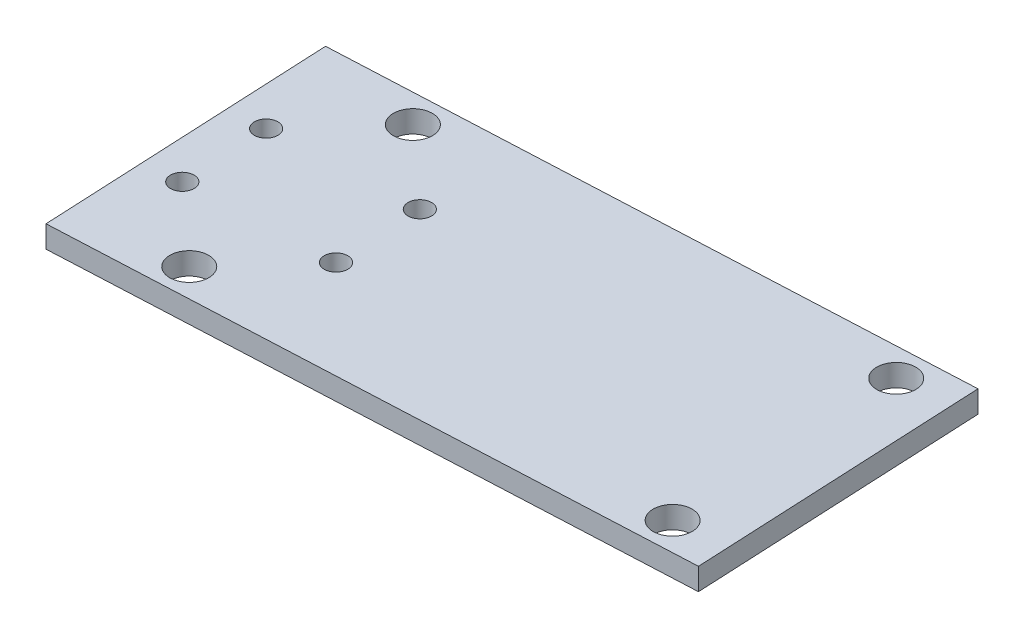
ISO-10303-21;
HEADER;
FILE_DESCRIPTION(('STEP AP214'),'2;1');
FILE_NAME('part.step','',(''),(''),'','','');
FILE_SCHEMA(('AUTOMOTIVE_DESIGN { 1 0 10303 214 1 1 1 1 }'));
ENDSEC;
DATA;
#1=APPLICATION_CONTEXT('core data for automotive mechanical design processes');
#2=APPLICATION_PROTOCOL_DEFINITION('international standard','automotive_design',2000,#1);
#3=PRODUCT_CONTEXT('',#1,'mechanical');
#4=PRODUCT('Part','Part','',(#3));
#5=PRODUCT_RELATED_PRODUCT_CATEGORY('part','',(#4));
#6=PRODUCT_DEFINITION_FORMATION('','',#4);
#7=PRODUCT_DEFINITION_CONTEXT('part definition',#1,'design');
#8=PRODUCT_DEFINITION('design','',#6,#7);
#9=PRODUCT_DEFINITION_SHAPE('','',#8);
#10=(LENGTH_UNIT() NAMED_UNIT(*) SI_UNIT(.MILLI.,.METRE.));
#11=(NAMED_UNIT(*) PLANE_ANGLE_UNIT() SI_UNIT($,.RADIAN.));
#12=(NAMED_UNIT(*) SI_UNIT($,.STERADIAN.) SOLID_ANGLE_UNIT());
#13=UNCERTAINTY_MEASURE_WITH_UNIT(LENGTH_MEASURE(1.E-05),#10,'distance_accuracy_value','');
#14=(GEOMETRIC_REPRESENTATION_CONTEXT(3) GLOBAL_UNCERTAINTY_ASSIGNED_CONTEXT((#13)) GLOBAL_UNIT_ASSIGNED_CONTEXT((#10,
#11,#12)) REPRESENTATION_CONTEXT('',''));
#15=CARTESIAN_POINT('',(0.,0.,0.));
#16=DIRECTION('',(0.,0.,1.));
#17=DIRECTION('',(1.,0.,0.));
#18=AXIS2_PLACEMENT_3D('',#15,#16,#17);
#19=CARTESIAN_POINT('',(0.,3.,0.));
#20=DIRECTION('',(0.,1.,0.));
#21=DIRECTION('',(0.,0.,1.));
#22=AXIS2_PLACEMENT_3D('',#19,#20,#21);
#23=PLANE('',#22);
#24=CARTESIAN_POINT('',(62.773467576915,3.,-19.533037480713));
#25=DIRECTION('',(0.,1.,0.));
#26=DIRECTION('',(0.,0.,1.));
#27=AXIS2_PLACEMENT_3D('',#24,#25,#26);
#28=CIRCLE('',#27,2.65);
#29=CARTESIAN_POINT('',(62.773467576915,3.,-16.883037480713));
#30=VERTEX_POINT('',#29);
#31=EDGE_CURVE('E145',#30,#30,#28,.T.);
#32=ORIENTED_EDGE('',*,*,#31,.F.);
#33=EDGE_LOOP('',(#32));
#34=FACE_BOUND('',#33,.T.);
#35=CARTESIAN_POINT('',(10.413791266194,3.,-7.03358197308624));
#36=DIRECTION('',(0.,1.,0.));
#37=DIRECTION('',(0.,0.,-1.));
#38=AXIS2_PLACEMENT_3D('',#35,#36,#37);
#39=CIRCLE('',#38,1.6);
#40=CARTESIAN_POINT('',(10.413791266194,3.,-8.63358197308624));
#41=VERTEX_POINT('',#40);
#42=EDGE_CURVE('E133',#41,#41,#39,.T.);
#43=ORIENTED_EDGE('',*,*,#42,.F.);
#44=EDGE_LOOP('',(#43));
#45=FACE_BOUND('',#44,.T.);
#46=CARTESIAN_POINT('',(-8.9940585563237,3.,5.90223517414487));
#47=DIRECTION('',(0.,1.,0.));
#48=DIRECTION('',(0.,0.,1.));
#49=AXIS2_PLACEMENT_3D('',#46,#47,#48);
#50=CIRCLE('',#49,1.6);
#51=CARTESIAN_POINT('',(-8.9940585563237,3.,7.50223517414487));
#52=VERTEX_POINT('',#51);
#53=EDGE_CURVE('E121',#52,#52,#50,.T.);
#54=ORIENTED_EDGE('',*,*,#53,.F.);
#55=EDGE_LOOP('',(#54));
#56=FACE_BOUND('',#55,.T.);
#57=CARTESIAN_POINT('',(-0.0496085001945169,3.,-16.5476381705627));
#58=DIRECTION('',(0.,1.,0.));
#59=DIRECTION('',(0.,0.,1.));
#60=AXIS2_PLACEMENT_3D('',#57,#58,#59);
#61=CIRCLE('',#60,2.65);
#62=CARTESIAN_POINT('',(-0.0496085001945169,3.,-13.8976381705627));
#63=VERTEX_POINT('',#62);
#64=EDGE_CURVE('E103',#63,#63,#61,.T.);
#65=ORIENTED_EDGE('',*,*,#64,.F.);
#66=EDGE_LOOP('',(#65));
#67=FACE_BOUND('',#66,.T.);
#68=DIRECTION('',(0.0474671784456058,0.,0.99887279819325));
#69=VECTOR('',#68,1.);
#70=CARTESIAN_POINT('',(-15.2225691868757,3.,-19.8311216866516));
#71=LINE('',#70,#69);
#72=CARTESIAN_POINT('',(-15.2225691868757,3.,-19.8311216866516));
#73=VERTEX_POINT('',#72);
#74=CARTESIAN_POINT('',(-13.3238820490515,3.,20.1237902410784));
#75=VERTEX_POINT('',#74);
#76=EDGE_CURVE('E86',#73,#75,#71,.T.);
#77=ORIENTED_EDGE('',*,*,#76,.T.);
#78=DIRECTION('',(0.99887279819325,0.,-0.0474671784456056));
#79=VECTOR('',#78,1.);
#80=CARTESIAN_POINT('',(-13.3238820490515,3.,20.1237902410784));
#81=LINE('',#80,#79);
#82=CARTESIAN_POINT('',(71.4743955883095,3.,16.0941130051248));
#83=VERTEX_POINT('',#82);
#84=EDGE_CURVE('E80',#75,#83,#81,.T.);
#85=ORIENTED_EDGE('',*,*,#84,.T.);
#86=DIRECTION('',(-0.0474671784456058,0.,-0.99887279819325));
#87=VECTOR('',#86,1.);
#88=CARTESIAN_POINT('',(69.5757084504853,3.,-23.8607989226052));
#89=LINE('',#88,#87);
#90=CARTESIAN_POINT('',(69.5757084504853,3.,-23.8607989226052));
#91=VERTEX_POINT('',#90);
#92=EDGE_CURVE('E83',#83,#91,#89,.T.);
#93=ORIENTED_EDGE('',*,*,#92,.T.);
#94=DIRECTION('',(-0.99887279819325,0.,0.0474671784456059));
#95=VECTOR('',#94,1.);
#96=CARTESIAN_POINT('',(14.7436147589218,3.,-21.2551370400198));
#97=LINE('',#96,#95);
#98=EDGE_CURVE('E52',#91,#73,#97,.T.);
#99=ORIENTED_EDGE('',*,*,#98,.T.);
#100=EDGE_LOOP('',(#77,#85,#93,#99));
#101=FACE_BOUND('',#100,.T.);
#102=CARTESIAN_POINT('',(1.46934121006486,3.,15.4162913716213));
#103=DIRECTION('',(0.,1.,0.));
#104=DIRECTION('',(0.,0.,1.));
#105=AXIS2_PLACEMENT_3D('',#102,#103,#104);
#106=CIRCLE('',#105,2.65);
#107=CARTESIAN_POINT('',(1.46934121006486,3.,18.0662913716213));
#108=VERTEX_POINT('',#107);
#109=EDGE_CURVE('E115',#108,#108,#106,.T.);
#110=ORIENTED_EDGE('',*,*,#109,.F.);
#111=EDGE_LOOP('',(#110));
#112=FACE_BOUND('',#111,.T.);
#113=CARTESIAN_POINT('',(-9.56366469767096,3.,-6.08423840417413));
#114=DIRECTION('',(0.,1.,0.));
#115=DIRECTION('',(0.,0.,1.));
#116=AXIS2_PLACEMENT_3D('',#113,#114,#115);
#117=CIRCLE('',#116,1.6);
#118=CARTESIAN_POINT('',(-9.56366469767096,3.,-4.48423840417412));
#119=VERTEX_POINT('',#118);
#120=EDGE_CURVE('E127',#119,#119,#117,.T.);
#121=ORIENTED_EDGE('',*,*,#120,.F.);
#122=EDGE_LOOP('',(#121));
#123=FACE_BOUND('',#122,.T.);
#124=CARTESIAN_POINT('',(10.9833974075413,3.,4.95289160523276));
#125=DIRECTION('',(0.,1.,0.));
#126=DIRECTION('',(0.,0.,-1.));
#127=AXIS2_PLACEMENT_3D('',#124,#125,#126);
#128=CIRCLE('',#127,1.6);
#129=CARTESIAN_POINT('',(10.9833974075413,3.,3.35289160523276));
#130=VERTEX_POINT('',#129);
#131=EDGE_CURVE('E139',#130,#130,#128,.T.);
#132=ORIENTED_EDGE('',*,*,#131,.F.);
#133=EDGE_LOOP('',(#132));
#134=FACE_BOUND('',#133,.T.);
#135=CARTESIAN_POINT('',(64.2924172871744,3.,12.430892061471));
#136=DIRECTION('',(0.,1.,0.));
#137=DIRECTION('',(0.,0.,1.));
#138=AXIS2_PLACEMENT_3D('',#135,#136,#137);
#139=CIRCLE('',#138,2.65);
#140=CARTESIAN_POINT('',(64.2924172871744,3.,15.080892061471));
#141=VERTEX_POINT('',#140);
#142=EDGE_CURVE('E151',#141,#141,#139,.T.);
#143=ORIENTED_EDGE('',*,*,#142,.F.);
#144=EDGE_LOOP('',(#143));
#145=FACE_BOUND('',#144,.T.);
#146=ADVANCED_FACE('F35',(#34,#45,#56,#67,#101,#112,#123,#134,#145),#23,.T.);
#147=CARTESIAN_POINT('',(0.,0.,0.));
#148=DIRECTION('',(0.,1.,0.));
#149=DIRECTION('',(0.,0.,1.));
#150=AXIS2_PLACEMENT_3D('',#147,#148,#149);
#151=PLANE('',#150);
#152=DIRECTION('',(0.0474671784456058,0.,0.99887279819325));
#153=VECTOR('',#152,1.);
#154=CARTESIAN_POINT('',(-15.2225691868757,0.,-19.8311216866516));
#155=LINE('',#154,#153);
#156=CARTESIAN_POINT('',(-15.2225691868757,0.,-19.8311216866516));
#157=VERTEX_POINT('',#156);
#158=CARTESIAN_POINT('',(-13.3238820490515,0.,20.1237902410784));
#159=VERTEX_POINT('',#158);
#160=EDGE_CURVE('E100',#157,#159,#155,.T.);
#161=ORIENTED_EDGE('',*,*,#160,.F.);
#162=DIRECTION('',(-0.99887279819325,0.,0.0474671784456055));
#163=VECTOR('',#162,1.);
#164=CARTESIAN_POINT('',(-15.2225691868757,0.,-19.8311216866516));
#165=LINE('',#164,#163);
#166=CARTESIAN_POINT('',(69.5757084504853,0.,-23.8607989226052));
#167=VERTEX_POINT('',#166);
#168=EDGE_CURVE('E69',#167,#157,#165,.T.);
#169=ORIENTED_EDGE('',*,*,#168,.F.);
#170=DIRECTION('',(-0.0474671784456058,0.,-0.99887279819325));
#171=VECTOR('',#170,1.);
#172=CARTESIAN_POINT('',(69.5757084504853,0.,-23.8607989226052));
#173=LINE('',#172,#171);
#174=CARTESIAN_POINT('',(71.4743955883095,0.,16.0941130051248));
#175=VERTEX_POINT('',#174);
#176=EDGE_CURVE('E105',#175,#167,#173,.T.);
#177=ORIENTED_EDGE('',*,*,#176,.F.);
#178=DIRECTION('',(0.99887279819325,0.,-0.0474671784456057));
#179=VECTOR('',#178,1.);
#180=CARTESIAN_POINT('',(71.4743955883095,0.,16.0941130051248));
#181=LINE('',#180,#179);
#182=EDGE_CURVE('E91',#159,#175,#181,.T.);
#183=ORIENTED_EDGE('',*,*,#182,.F.);
#184=EDGE_LOOP('',(#161,#169,#177,#183));
#185=FACE_BOUND('',#184,.T.);
#186=CARTESIAN_POINT('',(-0.0496085001945169,0.,-16.5476381705627));
#187=DIRECTION('',(0.,1.,0.));
#188=DIRECTION('',(0.,0.,1.));
#189=AXIS2_PLACEMENT_3D('',#186,#187,#188);
#190=CIRCLE('',#189,2.65);
#191=CARTESIAN_POINT('',(-0.0496085001945169,0.,-13.8976381705627));
#192=VERTEX_POINT('',#191);
#193=EDGE_CURVE('E112',#192,#192,#190,.T.);
#194=ORIENTED_EDGE('',*,*,#193,.T.);
#195=EDGE_LOOP('',(#194));
#196=FACE_BOUND('',#195,.T.);
#197=CARTESIAN_POINT('',(1.46934121006486,0.,15.4162913716213));
#198=DIRECTION('',(0.,1.,0.));
#199=DIRECTION('',(0.,0.,1.));
#200=AXIS2_PLACEMENT_3D('',#197,#198,#199);
#201=CIRCLE('',#200,2.65);
#202=CARTESIAN_POINT('',(1.46934121006486,0.,18.0662913716213));
#203=VERTEX_POINT('',#202);
#204=EDGE_CURVE('E118',#203,#203,#201,.T.);
#205=ORIENTED_EDGE('',*,*,#204,.T.);
#206=EDGE_LOOP('',(#205));
#207=FACE_BOUND('',#206,.T.);
#208=CARTESIAN_POINT('',(-8.9940585563237,0.,5.90223517414487));
#209=DIRECTION('',(0.,1.,0.));
#210=DIRECTION('',(0.,0.,1.));
#211=AXIS2_PLACEMENT_3D('',#208,#209,#210);
#212=CIRCLE('',#211,1.6);
#213=CARTESIAN_POINT('',(-8.9940585563237,0.,7.50223517414487));
#214=VERTEX_POINT('',#213);
#215=EDGE_CURVE('E124',#214,#214,#212,.T.);
#216=ORIENTED_EDGE('',*,*,#215,.T.);
#217=EDGE_LOOP('',(#216));
#218=FACE_BOUND('',#217,.T.);
#219=CARTESIAN_POINT('',(-9.56366469767096,0.,-6.08423840417413));
#220=DIRECTION('',(0.,1.,0.));
#221=DIRECTION('',(0.,0.,1.));
#222=AXIS2_PLACEMENT_3D('',#219,#220,#221);
#223=CIRCLE('',#222,1.6);
#224=CARTESIAN_POINT('',(-9.56366469767096,0.,-4.48423840417412));
#225=VERTEX_POINT('',#224);
#226=EDGE_CURVE('E130',#225,#225,#223,.T.);
#227=ORIENTED_EDGE('',*,*,#226,.T.);
#228=EDGE_LOOP('',(#227));
#229=FACE_BOUND('',#228,.T.);
#230=CARTESIAN_POINT('',(10.413791266194,0.,-7.03358197308624));
#231=DIRECTION('',(0.,1.,0.));
#232=DIRECTION('',(0.,0.,-1.));
#233=AXIS2_PLACEMENT_3D('',#230,#231,#232);
#234=CIRCLE('',#233,1.6);
#235=CARTESIAN_POINT('',(10.413791266194,0.,-8.63358197308624));
#236=VERTEX_POINT('',#235);
#237=EDGE_CURVE('E136',#236,#236,#234,.T.);
#238=ORIENTED_EDGE('',*,*,#237,.T.);
#239=EDGE_LOOP('',(#238));
#240=FACE_BOUND('',#239,.T.);
#241=CARTESIAN_POINT('',(10.9833974075413,0.,4.95289160523276));
#242=DIRECTION('',(0.,1.,0.));
#243=DIRECTION('',(0.,0.,-1.));
#244=AXIS2_PLACEMENT_3D('',#241,#242,#243);
#245=CIRCLE('',#244,1.6);
#246=CARTESIAN_POINT('',(10.9833974075413,0.,3.35289160523276));
#247=VERTEX_POINT('',#246);
#248=EDGE_CURVE('E142',#247,#247,#245,.T.);
#249=ORIENTED_EDGE('',*,*,#248,.T.);
#250=EDGE_LOOP('',(#249));
#251=FACE_BOUND('',#250,.T.);
#252=CARTESIAN_POINT('',(62.773467576915,0.,-19.533037480713));
#253=DIRECTION('',(0.,1.,0.));
#254=DIRECTION('',(0.,0.,1.));
#255=AXIS2_PLACEMENT_3D('',#252,#253,#254);
#256=CIRCLE('',#255,2.65);
#257=CARTESIAN_POINT('',(62.773467576915,0.,-16.883037480713));
#258=VERTEX_POINT('',#257);
#259=EDGE_CURVE('E148',#258,#258,#256,.T.);
#260=ORIENTED_EDGE('',*,*,#259,.T.);
#261=EDGE_LOOP('',(#260));
#262=FACE_BOUND('',#261,.T.);
#263=CARTESIAN_POINT('',(64.2924172871744,0.,12.430892061471));
#264=DIRECTION('',(0.,1.,0.));
#265=DIRECTION('',(0.,0.,1.));
#266=AXIS2_PLACEMENT_3D('',#263,#264,#265);
#267=CIRCLE('',#266,2.65);
#268=CARTESIAN_POINT('',(64.2924172871744,0.,15.080892061471));
#269=VERTEX_POINT('',#268);
#270=EDGE_CURVE('E154',#269,#269,#267,.T.);
#271=ORIENTED_EDGE('',*,*,#270,.T.);
#272=EDGE_LOOP('',(#271));
#273=FACE_BOUND('',#272,.T.);
#274=ADVANCED_FACE('F164',(#185,#196,#207,#218,#229,#240,#251,#262,#273),#151,.F.);
#275=CARTESIAN_POINT('',(-15.2225691868757,3.,-19.8311216866516));
#276=DIRECTION('',(0.99887279819325,0.,-0.0474671784456058));
#277=DIRECTION('',(-0.0474671784456058,0.,-0.99887279819325));
#278=AXIS2_PLACEMENT_3D('',#275,#276,#277);
#279=PLANE('',#278);
#280=ORIENTED_EDGE('',*,*,#160,.T.);
#281=DIRECTION('',(0.,-1.,0.));
#282=VECTOR('',#281,1.);
#283=CARTESIAN_POINT('',(-13.3238820490515,3.,20.1237902410784));
#284=LINE('',#283,#282);
#285=EDGE_CURVE('E11',#75,#159,#284,.T.);
#286=ORIENTED_EDGE('',*,*,#285,.F.);
#287=ORIENTED_EDGE('',*,*,#76,.F.);
#288=DIRECTION('',(0.,-1.,0.));
#289=VECTOR('',#288,1.);
#290=CARTESIAN_POINT('',(-15.2225691868757,3.,-19.8311216866516));
#291=LINE('',#290,#289);
#292=EDGE_CURVE('E96',#73,#157,#291,.T.);
#293=ORIENTED_EDGE('',*,*,#292,.T.);
#294=EDGE_LOOP('',(#280,#286,#287,#293));
#295=FACE_BOUND('',#294,.T.);
#296=ADVANCED_FACE('F37',(#295),#279,.F.);
#297=CARTESIAN_POINT('',(71.4743955883095,3.,16.0941130051248));
#298=DIRECTION('',(-0.0474671784456057,0.,-0.99887279819325));
#299=DIRECTION('',(-0.99887279819325,0.,0.0474671784456057));
#300=AXIS2_PLACEMENT_3D('',#297,#298,#299);
#301=PLANE('',#300);
#302=ORIENTED_EDGE('',*,*,#182,.T.);
#303=DIRECTION('',(0.,-1.,0.));
#304=VECTOR('',#303,1.);
#305=CARTESIAN_POINT('',(71.4743955883095,3.,16.0941130051248));
#306=LINE('',#305,#304);
#307=EDGE_CURVE('E44',#83,#175,#306,.T.);
#308=ORIENTED_EDGE('',*,*,#307,.F.);
#309=ORIENTED_EDGE('',*,*,#84,.F.);
#310=ORIENTED_EDGE('',*,*,#285,.T.);
#311=EDGE_LOOP('',(#302,#308,#309,#310));
#312=FACE_BOUND('',#311,.T.);
#313=ADVANCED_FACE('F90',(#312),#301,.F.);
#314=CARTESIAN_POINT('',(69.5757084504853,3.,-23.8607989226052));
#315=DIRECTION('',(-0.99887279819325,0.,0.0474671784456058));
#316=DIRECTION('',(0.0474671784456058,0.,0.99887279819325));
#317=AXIS2_PLACEMENT_3D('',#314,#315,#316);
#318=PLANE('',#317);
#319=ORIENTED_EDGE('',*,*,#176,.T.);
#320=DIRECTION('',(0.,-1.,0.));
#321=VECTOR('',#320,1.);
#322=CARTESIAN_POINT('',(69.5757084504853,3.,-23.8607989226052));
#323=LINE('',#322,#321);
#324=EDGE_CURVE('E93',#91,#167,#323,.T.);
#325=ORIENTED_EDGE('',*,*,#324,.F.);
#326=ORIENTED_EDGE('',*,*,#92,.F.);
#327=ORIENTED_EDGE('',*,*,#307,.T.);
#328=EDGE_LOOP('',(#319,#325,#326,#327));
#329=FACE_BOUND('',#328,.T.);
#330=ADVANCED_FACE('F94',(#329),#318,.F.);
#331=CARTESIAN_POINT('',(-15.2225691868757,3.,-19.8311216866516));
#332=DIRECTION('',(0.0474671784456055,0.,0.99887279819325));
#333=DIRECTION('',(0.99887279819325,0.,-0.0474671784456055));
#334=AXIS2_PLACEMENT_3D('',#331,#332,#333);
#335=PLANE('',#334);
#336=ORIENTED_EDGE('',*,*,#168,.T.);
#337=ORIENTED_EDGE('',*,*,#292,.F.);
#338=ORIENTED_EDGE('',*,*,#98,.F.);
#339=ORIENTED_EDGE('',*,*,#324,.T.);
#340=EDGE_LOOP('',(#336,#337,#338,#339));
#341=FACE_BOUND('',#340,.T.);
#342=ADVANCED_FACE('F109',(#341),#335,.F.);
#343=CARTESIAN_POINT('',(-0.0496085001945169,3.,-16.5476381705627));
#344=DIRECTION('',(0.,-1.,0.));
#345=DIRECTION('',(0.,0.,-1.));
#346=AXIS2_PLACEMENT_3D('',#343,#344,#345);
#347=CYLINDRICAL_SURFACE('',#346,2.65);
#348=ORIENTED_EDGE('',*,*,#64,.T.);
#349=EDGE_LOOP('',(#348));
#350=FACE_BOUND('',#349,.T.);
#351=ORIENTED_EDGE('',*,*,#193,.F.);
#352=EDGE_LOOP('',(#351));
#353=FACE_BOUND('',#352,.T.);
#354=ADVANCED_FACE('F174',(#350,#353),#347,.F.);
#355=CARTESIAN_POINT('',(1.46934121006486,3.,15.4162913716213));
#356=DIRECTION('',(0.,-1.,0.));
#357=DIRECTION('',(0.,0.,-1.));
#358=AXIS2_PLACEMENT_3D('',#355,#356,#357);
#359=CYLINDRICAL_SURFACE('',#358,2.65);
#360=ORIENTED_EDGE('',*,*,#109,.T.);
#361=EDGE_LOOP('',(#360));
#362=FACE_BOUND('',#361,.T.);
#363=ORIENTED_EDGE('',*,*,#204,.F.);
#364=EDGE_LOOP('',(#363));
#365=FACE_BOUND('',#364,.T.);
#366=ADVANCED_FACE('F226',(#362,#365),#359,.F.);
#367=CARTESIAN_POINT('',(-8.9940585563237,3.,5.90223517414487));
#368=DIRECTION('',(0.,-1.,0.));
#369=DIRECTION('',(0.,0.,-1.));
#370=AXIS2_PLACEMENT_3D('',#367,#368,#369);
#371=CYLINDRICAL_SURFACE('',#370,1.6);
#372=ORIENTED_EDGE('',*,*,#53,.T.);
#373=EDGE_LOOP('',(#372));
#374=FACE_BOUND('',#373,.T.);
#375=ORIENTED_EDGE('',*,*,#215,.F.);
#376=EDGE_LOOP('',(#375));
#377=FACE_BOUND('',#376,.T.);
#378=ADVANCED_FACE('F234',(#374,#377),#371,.F.);
#379=CARTESIAN_POINT('',(-9.56366469767096,3.,-6.08423840417413));
#380=DIRECTION('',(0.,-1.,0.));
#381=DIRECTION('',(0.,0.,-1.));
#382=AXIS2_PLACEMENT_3D('',#379,#380,#381);
#383=CYLINDRICAL_SURFACE('',#382,1.6);
#384=ORIENTED_EDGE('',*,*,#120,.T.);
#385=EDGE_LOOP('',(#384));
#386=FACE_BOUND('',#385,.T.);
#387=ORIENTED_EDGE('',*,*,#226,.F.);
#388=EDGE_LOOP('',(#387));
#389=FACE_BOUND('',#388,.T.);
#390=ADVANCED_FACE('F242',(#386,#389),#383,.F.);
#391=CARTESIAN_POINT('',(10.413791266194,3.,-7.03358197308624));
#392=DIRECTION('',(0.,-1.,0.));
#393=DIRECTION('',(0.,0.,-1.));
#394=AXIS2_PLACEMENT_3D('',#391,#392,#393);
#395=CYLINDRICAL_SURFACE('',#394,1.6);
#396=ORIENTED_EDGE('',*,*,#42,.T.);
#397=EDGE_LOOP('',(#396));
#398=FACE_BOUND('',#397,.T.);
#399=ORIENTED_EDGE('',*,*,#237,.F.);
#400=EDGE_LOOP('',(#399));
#401=FACE_BOUND('',#400,.T.);
#402=ADVANCED_FACE('F251',(#398,#401),#395,.F.);
#403=CARTESIAN_POINT('',(10.9833974075413,3.,4.95289160523276));
#404=DIRECTION('',(0.,-1.,0.));
#405=DIRECTION('',(0.,0.,-1.));
#406=AXIS2_PLACEMENT_3D('',#403,#404,#405);
#407=CYLINDRICAL_SURFACE('',#406,1.6);
#408=ORIENTED_EDGE('',*,*,#131,.T.);
#409=EDGE_LOOP('',(#408));
#410=FACE_BOUND('',#409,.T.);
#411=ORIENTED_EDGE('',*,*,#248,.F.);
#412=EDGE_LOOP('',(#411));
#413=FACE_BOUND('',#412,.T.);
#414=ADVANCED_FACE('F260',(#410,#413),#407,.F.);
#415=CARTESIAN_POINT('',(62.773467576915,3.,-19.533037480713));
#416=DIRECTION('',(0.,-1.,0.));
#417=DIRECTION('',(0.,0.,-1.));
#418=AXIS2_PLACEMENT_3D('',#415,#416,#417);
#419=CYLINDRICAL_SURFACE('',#418,2.65);
#420=ORIENTED_EDGE('',*,*,#31,.T.);
#421=EDGE_LOOP('',(#420));
#422=FACE_BOUND('',#421,.T.);
#423=ORIENTED_EDGE('',*,*,#259,.F.);
#424=EDGE_LOOP('',(#423));
#425=FACE_BOUND('',#424,.T.);
#426=ADVANCED_FACE('F269',(#422,#425),#419,.F.);
#427=CARTESIAN_POINT('',(64.2924172871744,3.,12.430892061471));
#428=DIRECTION('',(0.,-1.,0.));
#429=DIRECTION('',(0.,0.,-1.));
#430=AXIS2_PLACEMENT_3D('',#427,#428,#429);
#431=CYLINDRICAL_SURFACE('',#430,2.65);
#432=ORIENTED_EDGE('',*,*,#142,.T.);
#433=EDGE_LOOP('',(#432));
#434=FACE_BOUND('',#433,.T.);
#435=ORIENTED_EDGE('',*,*,#270,.F.);
#436=EDGE_LOOP('',(#435));
#437=FACE_BOUND('',#436,.T.);
#438=ADVANCED_FACE('F160',(#434,#437),#431,.F.);
#439=CLOSED_SHELL('',(#146,#274,#296,#313,#330,#342,#354,#366,#378,#390,#402,#414,#426,#438));
#440=MANIFOLD_SOLID_BREP('B2',#439);
#441=ADVANCED_BREP_SHAPE_REPRESENTATION('',(#18,#440),#14);
#442=SHAPE_DEFINITION_REPRESENTATION(#9,#441);
ENDSEC;
END-ISO-10303-21;
